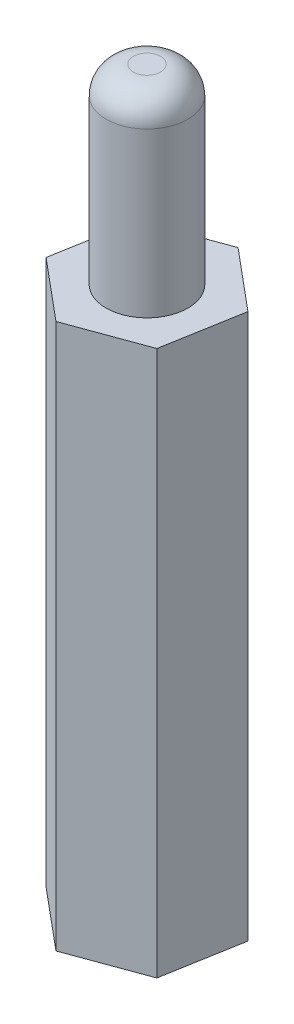
ISO-10303-21;
HEADER;
FILE_DESCRIPTION(('STEP AP214'),'2;1');
FILE_NAME('part.step','',(''),(''),'','','');
FILE_SCHEMA(('AUTOMOTIVE_DESIGN { 1 0 10303 214 1 1 1 1 }'));
ENDSEC;
DATA;
#1=APPLICATION_CONTEXT('core data for automotive mechanical design processes');
#2=APPLICATION_PROTOCOL_DEFINITION('international standard','automotive_design',2000,#1);
#3=PRODUCT_CONTEXT('',#1,'mechanical');
#4=PRODUCT('Part','Part','',(#3));
#5=PRODUCT_RELATED_PRODUCT_CATEGORY('part','',(#4));
#6=PRODUCT_DEFINITION_FORMATION('','',#4);
#7=PRODUCT_DEFINITION_CONTEXT('part definition',#1,'design');
#8=PRODUCT_DEFINITION('design','',#6,#7);
#9=PRODUCT_DEFINITION_SHAPE('','',#8);
#10=(LENGTH_UNIT() NAMED_UNIT(*) SI_UNIT(.MILLI.,.METRE.));
#11=(NAMED_UNIT(*) PLANE_ANGLE_UNIT() SI_UNIT($,.RADIAN.));
#12=(NAMED_UNIT(*) SI_UNIT($,.STERADIAN.) SOLID_ANGLE_UNIT());
#13=UNCERTAINTY_MEASURE_WITH_UNIT(LENGTH_MEASURE(1.E-05),#10,'distance_accuracy_value','');
#14=(GEOMETRIC_REPRESENTATION_CONTEXT(3) GLOBAL_UNCERTAINTY_ASSIGNED_CONTEXT((#13)) GLOBAL_UNIT_ASSIGNED_CONTEXT((#10,
#11,#12)) REPRESENTATION_CONTEXT('',''));
#15=CARTESIAN_POINT('',(0.,0.,0.));
#16=DIRECTION('',(0.,0.,1.));
#17=DIRECTION('',(1.,0.,0.));
#18=AXIS2_PLACEMENT_3D('',#15,#16,#17);
#19=CARTESIAN_POINT('',(-0.495994709202007,20.,2.84382182665809));
#20=DIRECTION('',(-0.343765976383913,0.,-0.939055351659749));
#21=DIRECTION('',(-0.939055351659749,0.,0.343765976383913));
#22=AXIS2_PLACEMENT_3D('',#19,#20,#21);
#23=PLANE('',#22);
#24=DIRECTION('',(0.939055351659749,0.,-0.343765976383913));
#25=VECTOR('',#24,1.);
#26=CARTESIAN_POINT('',(-0.495994709202007,0.,2.84382182665809));
#27=LINE('',#26,#25);
#28=CARTESIAN_POINT('',(-0.495994709202007,0.,2.84382182665809));
#29=VERTEX_POINT('',#28);
#30=CARTESIAN_POINT('',(2.21482459112157,0.,1.85145493164066));
#31=VERTEX_POINT('',#30);
#32=EDGE_CURVE('E134',#29,#31,#27,.T.);
#33=ORIENTED_EDGE('',*,*,#32,.T.);
#34=DIRECTION('',(0.,-1.,0.));
#35=VECTOR('',#34,1.);
#36=CARTESIAN_POINT('',(2.21482459112157,20.,1.85145493164066));
#37=LINE('',#36,#35);
#38=CARTESIAN_POINT('',(2.21482459112157,20.,1.85145493164066));
#39=VERTEX_POINT('',#38);
#40=EDGE_CURVE('E162',#39,#31,#37,.T.);
#41=ORIENTED_EDGE('',*,*,#40,.F.);
#42=DIRECTION('',(0.939055351659749,0.,-0.343765976383913));
#43=VECTOR('',#42,1.);
#44=CARTESIAN_POINT('',(-0.495994709202007,20.,2.84382182665809));
#45=LINE('',#44,#43);
#46=CARTESIAN_POINT('',(-0.495994709202007,20.,2.84382182665809));
#47=VERTEX_POINT('',#46);
#48=EDGE_CURVE('E151',#47,#39,#45,.T.);
#49=ORIENTED_EDGE('',*,*,#48,.F.);
#50=DIRECTION('',(0.,-1.,0.));
#51=VECTOR('',#50,1.);
#52=CARTESIAN_POINT('',(-0.495994709202007,20.,2.84382182665809));
#53=LINE('',#52,#51);
#54=EDGE_CURVE('E130',#47,#29,#53,.T.);
#55=ORIENTED_EDGE('',*,*,#54,.T.);
#56=EDGE_LOOP('',(#33,#41,#49,#55));
#57=FACE_BOUND('',#56,.T.);
#58=ADVANCED_FACE('F43',(#57),#23,.F.);
#59=CARTESIAN_POINT('',(2.21482459112157,20.,1.85145493164066));
#60=DIRECTION('',(-0.985128778289029,0.,-0.171817607324645));
#61=DIRECTION('',(-0.171817607324645,0.,0.985128778289029));
#62=AXIS2_PLACEMENT_3D('',#59,#60,#61);
#63=PLANE('',#62);
#64=DIRECTION('',(0.171817607324645,0.,-0.985128778289029));
#65=VECTOR('',#64,1.);
#66=CARTESIAN_POINT('',(2.21482459112157,0.,1.85145493164066));
#67=LINE('',#66,#65);
#68=CARTESIAN_POINT('',(2.71081930032357,0.,-0.992366895017432));
#69=VERTEX_POINT('',#68);
#70=EDGE_CURVE('E138',#31,#69,#67,.T.);
#71=ORIENTED_EDGE('',*,*,#70,.T.);
#72=DIRECTION('',(0.,-1.,0.));
#73=VECTOR('',#72,1.);
#74=CARTESIAN_POINT('',(2.71081930032357,20.,-0.992366895017432));
#75=LINE('',#74,#73);
#76=CARTESIAN_POINT('',(2.71081930032357,20.,-0.992366895017432));
#77=VERTEX_POINT('',#76);
#78=EDGE_CURVE('E158',#77,#69,#75,.T.);
#79=ORIENTED_EDGE('',*,*,#78,.F.);
#80=DIRECTION('',(0.171817607324645,0.,-0.985128778289029));
#81=VECTOR('',#80,1.);
#82=CARTESIAN_POINT('',(2.21482459112157,20.,1.85145493164066));
#83=LINE('',#82,#81);
#84=EDGE_CURVE('E99',#39,#77,#83,.T.);
#85=ORIENTED_EDGE('',*,*,#84,.F.);
#86=ORIENTED_EDGE('',*,*,#40,.T.);
#87=EDGE_LOOP('',(#71,#79,#85,#86));
#88=FACE_BOUND('',#87,.T.);
#89=ADVANCED_FACE('F211',(#88),#63,.F.);
#90=CARTESIAN_POINT('',(2.71081930032357,20.,-0.992366895017432));
#91=DIRECTION('',(-0.641362801905116,0.,0.767237744335104));
#92=DIRECTION('',(0.767237744335104,0.,0.641362801905116));
#93=AXIS2_PLACEMENT_3D('',#90,#91,#92);
#94=PLANE('',#93);
#95=DIRECTION('',(-0.767237744335104,0.,-0.641362801905116));
#96=VECTOR('',#95,1.);
#97=CARTESIAN_POINT('',(2.71081930032357,0.,-0.992366895017432));
#98=LINE('',#97,#96);
#99=CARTESIAN_POINT('',(0.495994709202006,0.,-2.84382182665809));
#100=VERTEX_POINT('',#99);
#101=EDGE_CURVE('E142',#69,#100,#98,.T.);
#102=ORIENTED_EDGE('',*,*,#101,.T.);
#103=DIRECTION('',(0.,-1.,0.));
#104=VECTOR('',#103,1.);
#105=CARTESIAN_POINT('',(0.495994709202006,20.,-2.84382182665809));
#106=LINE('',#105,#104);
#107=CARTESIAN_POINT('',(0.495994709202006,20.,-2.84382182665809));
#108=VERTEX_POINT('',#107);
#109=EDGE_CURVE('E123',#108,#100,#106,.T.);
#110=ORIENTED_EDGE('',*,*,#109,.F.);
#111=DIRECTION('',(-0.767237744335104,0.,-0.641362801905116));
#112=VECTOR('',#111,1.);
#113=CARTESIAN_POINT('',(2.71081930032357,20.,-0.992366895017432));
#114=LINE('',#113,#112);
#115=EDGE_CURVE('E112',#77,#108,#114,.T.);
#116=ORIENTED_EDGE('',*,*,#115,.F.);
#117=ORIENTED_EDGE('',*,*,#78,.T.);
#118=EDGE_LOOP('',(#102,#110,#116,#117));
#119=FACE_BOUND('',#118,.T.);
#120=ADVANCED_FACE('F215',(#119),#94,.F.);
#121=CARTESIAN_POINT('',(0.495994709202006,20.,-2.84382182665809));
#122=DIRECTION('',(0.343765976383912,0.,0.939055351659749));
#123=DIRECTION('',(0.939055351659749,0.,-0.343765976383912));
#124=AXIS2_PLACEMENT_3D('',#121,#122,#123);
#125=PLANE('',#124);
#126=DIRECTION('',(-0.939055351659749,0.,0.343765976383912));
#127=VECTOR('',#126,1.);
#128=CARTESIAN_POINT('',(0.495994709202006,0.,-2.84382182665809));
#129=LINE('',#128,#127);
#130=CARTESIAN_POINT('',(-2.21482459112157,0.,-1.85145493164066));
#131=VERTEX_POINT('',#130);
#132=EDGE_CURVE('E121',#100,#131,#129,.T.);
#133=ORIENTED_EDGE('',*,*,#132,.T.);
#134=DIRECTION('',(0.,-1.,0.));
#135=VECTOR('',#134,1.);
#136=CARTESIAN_POINT('',(-2.21482459112157,20.,-1.85145493164066));
#137=LINE('',#136,#135);
#138=CARTESIAN_POINT('',(-2.21482459112157,20.,-1.85145493164066));
#139=VERTEX_POINT('',#138);
#140=EDGE_CURVE('E118',#139,#131,#137,.T.);
#141=ORIENTED_EDGE('',*,*,#140,.F.);
#142=DIRECTION('',(-0.939055351659749,0.,0.343765976383912));
#143=VECTOR('',#142,1.);
#144=CARTESIAN_POINT('',(0.495994709202006,20.,-2.84382182665809));
#145=LINE('',#144,#143);
#146=EDGE_CURVE('E106',#108,#139,#145,.T.);
#147=ORIENTED_EDGE('',*,*,#146,.F.);
#148=ORIENTED_EDGE('',*,*,#109,.T.);
#149=EDGE_LOOP('',(#133,#141,#147,#148));
#150=FACE_BOUND('',#149,.T.);
#151=ADVANCED_FACE('F119',(#150),#125,.F.);
#152=CARTESIAN_POINT('',(-2.21482459112157,20.,-1.85145493164066));
#153=DIRECTION('',(0.985128778289029,0.,0.171817607324645));
#154=DIRECTION('',(0.171817607324645,0.,-0.985128778289029));
#155=AXIS2_PLACEMENT_3D('',#152,#153,#154);
#156=PLANE('',#155);
#157=DIRECTION('',(-0.171817607324645,0.,0.985128778289029));
#158=VECTOR('',#157,1.);
#159=CARTESIAN_POINT('',(-2.21482459112157,0.,-1.85145493164066));
#160=LINE('',#159,#158);
#161=CARTESIAN_POINT('',(-2.71081930032357,0.,0.992366895017432));
#162=VERTEX_POINT('',#161);
#163=EDGE_CURVE('E84',#131,#162,#160,.T.);
#164=ORIENTED_EDGE('',*,*,#163,.T.);
#165=DIRECTION('',(0.,-1.,0.));
#166=VECTOR('',#165,1.);
#167=CARTESIAN_POINT('',(-2.71081930032357,20.,0.992366895017432));
#168=LINE('',#167,#166);
#169=CARTESIAN_POINT('',(-2.71081930032357,20.,0.992366895017432));
#170=VERTEX_POINT('',#169);
#171=EDGE_CURVE('E124',#170,#162,#168,.T.);
#172=ORIENTED_EDGE('',*,*,#171,.F.);
#173=DIRECTION('',(-0.171817607324645,0.,0.985128778289029));
#174=VECTOR('',#173,1.);
#175=CARTESIAN_POINT('',(-2.21482459112157,20.,-1.85145493164066));
#176=LINE('',#175,#174);
#177=EDGE_CURVE('E110',#139,#170,#176,.T.);
#178=ORIENTED_EDGE('',*,*,#177,.F.);
#179=ORIENTED_EDGE('',*,*,#140,.T.);
#180=EDGE_LOOP('',(#164,#172,#178,#179));
#181=FACE_BOUND('',#180,.T.);
#182=ADVANCED_FACE('F126',(#181),#156,.F.);
#183=CARTESIAN_POINT('',(-2.71081930032357,20.,0.992366895017432));
#184=DIRECTION('',(0.641362801905116,0.,-0.767237744335104));
#185=DIRECTION('',(-0.767237744335104,0.,-0.641362801905116));
#186=AXIS2_PLACEMENT_3D('',#183,#184,#185);
#187=PLANE('',#186);
#188=DIRECTION('',(0.767237744335104,0.,0.641362801905116));
#189=VECTOR('',#188,1.);
#190=CARTESIAN_POINT('',(-2.71081930032357,0.,0.992366895017432));
#191=LINE('',#190,#189);
#192=EDGE_CURVE('E90',#162,#29,#191,.T.);
#193=ORIENTED_EDGE('',*,*,#192,.T.);
#194=ORIENTED_EDGE('',*,*,#54,.F.);
#195=DIRECTION('',(0.767237744335104,0.,0.641362801905116));
#196=VECTOR('',#195,1.);
#197=CARTESIAN_POINT('',(-2.71081930032357,20.,0.992366895017432));
#198=LINE('',#197,#196);
#199=EDGE_CURVE('E61',#170,#47,#198,.T.);
#200=ORIENTED_EDGE('',*,*,#199,.F.);
#201=ORIENTED_EDGE('',*,*,#171,.T.);
#202=EDGE_LOOP('',(#193,#194,#200,#201));
#203=FACE_BOUND('',#202,.T.);
#204=ADVANCED_FACE('F200',(#203),#187,.F.);
#205=CARTESIAN_POINT('',(0.,20.,0.));
#206=DIRECTION('',(0.,1.,0.));
#207=DIRECTION('',(0.,0.,1.));
#208=AXIS2_PLACEMENT_3D('',#205,#206,#207);
#209=PLANE('',#208);
#210=CARTESIAN_POINT('',(0.,20.,0.));
#211=DIRECTION('',(0.,1.,0.));
#212=DIRECTION('',(0.,0.,1.));
#213=AXIS2_PLACEMENT_3D('',#210,#211,#212);
#214=CIRCLE('',#213,1.5);
#215=CARTESIAN_POINT('',(0.,20.,1.5));
#216=VERTEX_POINT('',#215);
#217=EDGE_CURVE('E164',#216,#216,#214,.T.);
#218=ORIENTED_EDGE('',*,*,#217,.F.);
#219=EDGE_LOOP('',(#218));
#220=FACE_BOUND('',#219,.T.);
#221=ORIENTED_EDGE('',*,*,#48,.T.);
#222=ORIENTED_EDGE('',*,*,#84,.T.);
#223=ORIENTED_EDGE('',*,*,#115,.T.);
#224=ORIENTED_EDGE('',*,*,#146,.T.);
#225=ORIENTED_EDGE('',*,*,#177,.T.);
#226=ORIENTED_EDGE('',*,*,#199,.T.);
#227=EDGE_LOOP('',(#221,#222,#223,#224,#225,#226));
#228=FACE_BOUND('',#227,.T.);
#229=ADVANCED_FACE('F108',(#220,#228),#209,.T.);
#230=CARTESIAN_POINT('',(0.,0.,0.));
#231=DIRECTION('',(0.,1.,0.));
#232=DIRECTION('',(0.,0.,1.));
#233=AXIS2_PLACEMENT_3D('',#230,#231,#232);
#234=PLANE('',#233);
#235=CARTESIAN_POINT('',(0.,0.,0.));
#236=DIRECTION('',(0.,-1.,0.));
#237=DIRECTION('',(0.,0.,-1.));
#238=AXIS2_PLACEMENT_3D('',#235,#236,#237);
#239=CIRCLE('',#238,1.5);
#240=CARTESIAN_POINT('',(0.,0.,-1.5));
#241=VERTEX_POINT('',#240);
#242=EDGE_CURVE('E176',#241,#241,#239,.T.);
#243=ORIENTED_EDGE('',*,*,#242,.F.);
#244=EDGE_LOOP('',(#243));
#245=FACE_BOUND('',#244,.T.);
#246=ORIENTED_EDGE('',*,*,#32,.F.);
#247=ORIENTED_EDGE('',*,*,#192,.F.);
#248=ORIENTED_EDGE('',*,*,#163,.F.);
#249=ORIENTED_EDGE('',*,*,#132,.F.);
#250=ORIENTED_EDGE('',*,*,#101,.F.);
#251=ORIENTED_EDGE('',*,*,#70,.F.);
#252=EDGE_LOOP('',(#246,#247,#248,#249,#250,#251));
#253=FACE_BOUND('',#252,.T.);
#254=ADVANCED_FACE('F190',(#245,#253),#234,.F.);
#255=CARTESIAN_POINT('',(0.,27.,0.));
#256=DIRECTION('',(0.,-1.,0.));
#257=DIRECTION('',(0.,0.,-1.));
#258=AXIS2_PLACEMENT_3D('',#255,#256,#257);
#259=CYLINDRICAL_SURFACE('',#258,1.5);
#260=CARTESIAN_POINT('',(0.,26.,0.));
#261=DIRECTION('',(0.,1.,0.));
#262=DIRECTION('',(0.,0.,1.));
#263=AXIS2_PLACEMENT_3D('',#260,#261,#262);
#264=CIRCLE('',#263,1.5);
#265=CARTESIAN_POINT('',(0.,26.,1.5));
#266=VERTEX_POINT('',#265);
#267=EDGE_CURVE('E11',#266,#266,#264,.F.);
#268=ORIENTED_EDGE('',*,*,#267,.T.);
#269=EDGE_LOOP('',(#268));
#270=FACE_BOUND('',#269,.T.);
#271=ORIENTED_EDGE('',*,*,#217,.T.);
#272=EDGE_LOOP('',(#271));
#273=FACE_BOUND('',#272,.T.);
#274=ADVANCED_FACE('F193',(#270,#273),#259,.T.);
#275=CARTESIAN_POINT('',(0.,27.,0.));
#276=DIRECTION('',(0.,1.,0.));
#277=DIRECTION('',(0.,0.,1.));
#278=AXIS2_PLACEMENT_3D('',#275,#276,#277);
#279=PLANE('',#278);
#280=CARTESIAN_POINT('',(0.,27.,0.));
#281=DIRECTION('',(0.,1.,0.));
#282=DIRECTION('',(0.,0.,1.));
#283=AXIS2_PLACEMENT_3D('',#280,#281,#282);
#284=CIRCLE('',#283,0.5);
#285=CARTESIAN_POINT('',(0.,27.,0.5));
#286=VERTEX_POINT('',#285);
#287=EDGE_CURVE('E53',#286,#286,#284,.T.);
#288=ORIENTED_EDGE('',*,*,#287,.T.);
#289=EDGE_LOOP('',(#288));
#290=FACE_BOUND('',#289,.T.);
#291=ADVANCED_FACE('F262',(#290),#279,.T.);
#292=CARTESIAN_POINT('',(0.,7.,0.));
#293=DIRECTION('',(0.,-1.,0.));
#294=DIRECTION('',(0.,0.,-1.));
#295=AXIS2_PLACEMENT_3D('',#292,#293,#294);
#296=CYLINDRICAL_SURFACE('',#295,1.5);
#297=CARTESIAN_POINT('',(0.,7.,0.));
#298=DIRECTION('',(0.,-1.,0.));
#299=DIRECTION('',(0.,0.,-1.));
#300=AXIS2_PLACEMENT_3D('',#297,#298,#299);
#301=CIRCLE('',#300,1.5);
#302=CARTESIAN_POINT('',(0.,7.,-1.5));
#303=VERTEX_POINT('',#302);
#304=EDGE_CURVE('E139',#303,#303,#301,.T.);
#305=ORIENTED_EDGE('',*,*,#304,.F.);
#306=EDGE_LOOP('',(#305));
#307=FACE_BOUND('',#306,.T.);
#308=ORIENTED_EDGE('',*,*,#242,.T.);
#309=EDGE_LOOP('',(#308));
#310=FACE_BOUND('',#309,.T.);
#311=ADVANCED_FACE('F188',(#307,#310),#296,.F.);
#312=CARTESIAN_POINT('',(0.,7.,0.));
#313=DIRECTION('',(0.,-1.,0.));
#314=DIRECTION('',(0.,0.,-1.));
#315=AXIS2_PLACEMENT_3D('',#312,#313,#314);
#316=PLANE('',#315);
#317=ORIENTED_EDGE('',*,*,#304,.T.);
#318=EDGE_LOOP('',(#317));
#319=FACE_BOUND('',#318,.T.);
#320=ADVANCED_FACE('F261',(#319),#316,.T.);
#321=CARTESIAN_POINT('',(0.,26.,0.));
#322=DIRECTION('',(0.,1.,0.));
#323=DIRECTION('',(0.,0.,1.));
#324=AXIS2_PLACEMENT_3D('',#321,#322,#323);
#325=DEGENERATE_TOROIDAL_SURFACE('',#324,0.5,1.,.T.);
#326=ORIENTED_EDGE('',*,*,#267,.F.);
#327=EDGE_LOOP('',(#326));
#328=FACE_BOUND('',#327,.T.);
#329=ORIENTED_EDGE('',*,*,#287,.F.);
#330=EDGE_LOOP('',(#329));
#331=FACE_BOUND('',#330,.T.);
#332=ADVANCED_FACE('F45',(#328,#331),#325,.T.);
#333=CLOSED_SHELL('',(#58,#89,#120,#151,#182,#204,#229,#254,#274,#291,#311,#320,#332));
#334=MANIFOLD_SOLID_BREP('B2',#333);
#335=ADVANCED_BREP_SHAPE_REPRESENTATION('',(#18,#334),#14);
#336=SHAPE_DEFINITION_REPRESENTATION(#9,#335);
ENDSEC;
END-ISO-10303-21;
